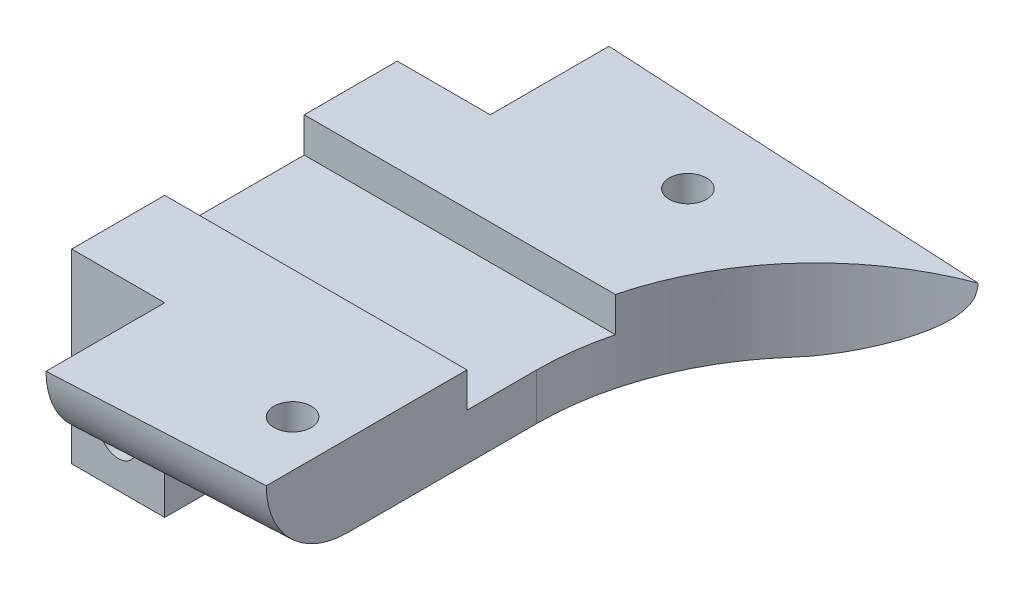
ISO-10303-21;
HEADER;
FILE_DESCRIPTION(('STEP AP214'),'2;1');
FILE_NAME('part.step','',(''),(''),'','','');
FILE_SCHEMA(('AUTOMOTIVE_DESIGN { 1 0 10303 214 1 1 1 1 }'));
ENDSEC;
DATA;
#1=APPLICATION_CONTEXT('core data for automotive mechanical design processes');
#2=APPLICATION_PROTOCOL_DEFINITION('international standard','automotive_design',2000,#1);
#3=PRODUCT_CONTEXT('',#1,'mechanical');
#4=PRODUCT('Part','Part','',(#3));
#5=PRODUCT_RELATED_PRODUCT_CATEGORY('part','',(#4));
#6=PRODUCT_DEFINITION_FORMATION('','',#4);
#7=PRODUCT_DEFINITION_CONTEXT('part definition',#1,'design');
#8=PRODUCT_DEFINITION('design','',#6,#7);
#9=PRODUCT_DEFINITION_SHAPE('','',#8);
#10=(LENGTH_UNIT() NAMED_UNIT(*) SI_UNIT(.MILLI.,.METRE.));
#11=(NAMED_UNIT(*) PLANE_ANGLE_UNIT() SI_UNIT($,.RADIAN.));
#12=(NAMED_UNIT(*) SI_UNIT($,.STERADIAN.) SOLID_ANGLE_UNIT());
#13=UNCERTAINTY_MEASURE_WITH_UNIT(LENGTH_MEASURE(1.E-05),#10,'distance_accuracy_value','');
#14=(GEOMETRIC_REPRESENTATION_CONTEXT(3) GLOBAL_UNCERTAINTY_ASSIGNED_CONTEXT((#13)) GLOBAL_UNIT_ASSIGNED_CONTEXT((#10,
#11,#12)) REPRESENTATION_CONTEXT('',''));
#15=CARTESIAN_POINT('',(0.,0.,0.));
#16=DIRECTION('',(0.,0.,1.));
#17=DIRECTION('',(1.,0.,0.));
#18=AXIS2_PLACEMENT_3D('',#15,#16,#17);
#19=CARTESIAN_POINT('',(0.,0.,0.));
#20=DIRECTION('',(0.,1.,0.));
#21=DIRECTION('',(0.,0.,1.));
#22=AXIS2_PLACEMENT_3D('',#19,#20,#21);
#23=PLANE('',#22);
#24=DIRECTION('',(-1.,0.,0.));
#25=VECTOR('',#24,1.);
#26=CARTESIAN_POINT('',(26.3810499613777,0.,-3.));
#27=LINE('',#26,#25);
#28=CARTESIAN_POINT('',(26.3810499613777,0.,-3.));
#29=VERTEX_POINT('',#28);
#30=CARTESIAN_POINT('',(13.,0.,-3.));
#31=VERTEX_POINT('',#30);
#32=EDGE_CURVE('E167',#29,#31,#27,.T.);
#33=ORIENTED_EDGE('',*,*,#32,.F.);
#34=CARTESIAN_POINT('',(38.,0.,0.));
#35=DIRECTION('',(0.,1.,0.));
#36=DIRECTION('',(0.,0.,1.));
#37=AXIS2_PLACEMENT_3D('',#34,#35,#36);
#38=CIRCLE('',#37,12.);
#39=CARTESIAN_POINT('',(33.7534704892804,0.,-11.2235015531958));
#40=VERTEX_POINT('',#39);
#41=EDGE_CURVE('E213',#40,#29,#38,.T.);
#42=ORIENTED_EDGE('',*,*,#41,.F.);
#43=DIRECTION('',(0.99861782933251,0.,0.0525588331227638));
#44=VECTOR('',#43,1.);
#45=CARTESIAN_POINT('',(0.682320441988952,0.,-12.9640883977901));
#46=LINE('',#45,#44);
#47=CARTESIAN_POINT('',(17.,0.,-12.1052631578947));
#48=VERTEX_POINT('',#47);
#49=EDGE_CURVE('E230',#48,#40,#46,.T.);
#50=ORIENTED_EDGE('',*,*,#49,.F.);
#51=DIRECTION('',(0.,0.,-1.));
#52=VECTOR('',#51,1.);
#53=CARTESIAN_POINT('',(17.,0.,0.));
#54=LINE('',#53,#52);
#55=CARTESIAN_POINT('',(17.,0.,-7.));
#56=VERTEX_POINT('',#55);
#57=EDGE_CURVE('E233',#56,#48,#54,.T.);
#58=ORIENTED_EDGE('',*,*,#57,.F.);
#59=DIRECTION('',(1.,0.,0.));
#60=VECTOR('',#59,1.);
#61=CARTESIAN_POINT('',(0.,0.,-7.));
#62=LINE('',#61,#60);
#63=CARTESIAN_POINT('',(13.,0.,-7.));
#64=VERTEX_POINT('',#63);
#65=EDGE_CURVE('E235',#64,#56,#62,.T.);
#66=ORIENTED_EDGE('',*,*,#65,.F.);
#67=DIRECTION('',(0.,0.,-1.));
#68=VECTOR('',#67,1.);
#69=CARTESIAN_POINT('',(13.,0.,0.));
#70=LINE('',#69,#68);
#71=EDGE_CURVE('E237',#31,#64,#70,.T.);
#72=ORIENTED_EDGE('',*,*,#71,.F.);
#73=EDGE_LOOP('',(#33,#42,#50,#58,#66,#72));
#74=FACE_BOUND('',#73,.T.);
#75=CARTESIAN_POINT('',(24.,0.,-8.5));
#76=DIRECTION('',(0.,1.,0.));
#77=DIRECTION('',(0.,0.,1.));
#78=AXIS2_PLACEMENT_3D('',#75,#76,#77);
#79=CIRCLE('',#78,0.799999999999999);
#80=CARTESIAN_POINT('',(24.,0.,-7.7));
#81=VERTEX_POINT('',#80);
#82=EDGE_CURVE('E208',#81,#81,#79,.T.);
#83=ORIENTED_EDGE('',*,*,#82,.F.);
#84=EDGE_LOOP('',(#83));
#85=FACE_BOUND('',#84,.T.);
#86=ADVANCED_FACE('F35',(#74,#85),#23,.T.);
#87=CARTESIAN_POINT('',(38.,-3.5,0.));
#88=DIRECTION('',(0.,1.,0.));
#89=DIRECTION('',(0.,0.,1.));
#90=AXIS2_PLACEMENT_3D('',#87,#88,#89);
#91=CYLINDRICAL_SURFACE('',#90,12.);
#92=CARTESIAN_POINT('',(38.,-3.5,0.));
#93=DIRECTION('',(0.,1.,0.));
#94=DIRECTION('',(0.,0.,1.));
#95=AXIS2_PLACEMENT_3D('',#92,#93,#94);
#96=CIRCLE('',#95,12.);
#97=CARTESIAN_POINT('',(29.0267068065038,-3.5,-7.96743429615551));
#98=VERTEX_POINT('',#97);
#99=CARTESIAN_POINT('',(26.,-3.5,0.));
#100=VERTEX_POINT('',#99);
#101=EDGE_CURVE('E216',#98,#100,#96,.T.);
#102=ORIENTED_EDGE('',*,*,#101,.F.);
#103=CARTESIAN_POINT('',(29.0267068065038,-3.5,-7.96743429615551));
#104=CARTESIAN_POINT('',(29.1252732668303,-3.49998592915876,-8.07847169006467));
#105=CARTESIAN_POINT('',(29.225875938758,-3.49422882603431,-8.18759867405111));
#106=CARTESIAN_POINT('',(29.4303821231229,-3.47218402390358,-8.40139212943517));
#107=CARTESIAN_POINT('',(29.5342817796478,-3.4559082243591,-8.50606349888512));
#108=CARTESIAN_POINT('',(29.7446788142223,-3.41380863622455,-8.71040655502651));
#109=CARTESIAN_POINT('',(29.8511720838343,-3.3879991339197,-8.81008547041522));
#110=CARTESIAN_POINT('',(30.0663558073956,-3.3276241290332,-9.00434943148595));
#111=CARTESIAN_POINT('',(30.1750471396214,-3.29305506015193,-9.09893238337351));
#112=CARTESIAN_POINT('',(30.4347936586531,-3.20148907211888,-9.3169796654036));
#113=CARTESIAN_POINT('',(30.5865702428945,-3.14093252659812,-9.43810253303063));
#114=CARTESIAN_POINT('',(30.8918335211635,-3.00597614305765,-9.67009578023478));
#115=CARTESIAN_POINT('',(31.0453208314689,-2.93157115403207,-9.78096232186822));
#116=CARTESIAN_POINT('',(31.3527130174929,-2.76963805891316,-9.99241667165639));
#117=CARTESIAN_POINT('',(31.5066181530424,-2.68209737842673,-10.092994473862));
#118=CARTESIAN_POINT('',(31.8129262540412,-2.49414470486446,-10.2836108850329));
#119=CARTESIAN_POINT('',(31.9653300027481,-2.39373985272426,-10.3736552884626));
#120=CARTESIAN_POINT('',(32.2728180980057,-2.17483217526493,-10.5466430611719));
#121=CARTESIAN_POINT('',(32.4277508224497,-2.05575082512826,-10.6291360892182));
#122=CARTESIAN_POINT('',(32.6539234009692,-1.86444098220462,-10.7436791773343));
#123=CARTESIAN_POINT('',(32.7282557430953,-1.79857744925735,-10.7803181208805));
#124=CARTESIAN_POINT('',(32.8740040079156,-1.66209687642385,-10.8503776082367));
#125=CARTESIAN_POINT('',(32.9454206641233,-1.59148104408478,-10.8837989644205));
#126=CARTESIAN_POINT('',(33.111819513482,-1.41570564880075,-10.9597910059007));
#127=CARTESIAN_POINT('',(33.2048822661748,-1.30797429777425,-11.0007164742283));
#128=CARTESIAN_POINT('',(33.3779073851249,-1.07975965164115,-11.0745219043443));
#129=CARTESIAN_POINT('',(33.4578926016463,-0.959299217824681,-11.1074159500909));
#130=CARTESIAN_POINT('',(33.5704765803645,-0.750407074012492,-11.1526495742201));
#131=CARTESIAN_POINT('',(33.609723805641,-0.666290177134787,-11.1681118713258));
#132=CARTESIAN_POINT('',(33.6756638478441,-0.492669699659191,-11.1938095934416));
#133=CARTESIAN_POINT('',(33.7024057320665,-0.403188753250098,-11.204065460758));
#134=CARTESIAN_POINT('',(33.731780145762,-0.260807190804394,-11.2152766574278));
#135=CARTESIAN_POINT('',(33.7398439949983,-0.20916760788626,-11.2183388956699));
#136=CARTESIAN_POINT('',(33.7507202468781,-0.105037502362144,-11.2224610650852));
#137=CARTESIAN_POINT('',(33.7535097116196,-0.052544259738826,-11.2235122505735));
#138=CARTESIAN_POINT('',(33.7534704892804,0.,-11.2235015531958));
#139=B_SPLINE_CURVE_WITH_KNOTS('',3,(#103,#104,#105,#106,#107,#108,#109,#110,#111,#112,#113,
#114,#115,#116,#117,#118,#119,#120,#121,#122,#123,#124,#125,#126,#127,#128,#129,#130,#131,#132,
#133,#134,#135,#136,#137,#138),.UNSPECIFIED.,.F.,.F.,(4,2,2,2,2,2,2,2,2,2,2,2,2,2,2,2,2,4),(0.,
0.44517512828659,0.889847523774546,1.33385626163774,1.7780460609189,2.38743771444605,
2.99705648923118,3.60726260081857,4.21713144116072,4.85233365635855,5.16974972326408,
5.48708543788266,5.9305856332474,6.3733024259465,6.65476901126952,6.93512174069319,
7.09190108610007,7.24936069879027),.UNSPECIFIED.);
#140=EDGE_CURVE('E44',#98,#40,#139,.T.);
#141=ORIENTED_EDGE('',*,*,#140,.T.);
#142=ORIENTED_EDGE('',*,*,#41,.T.);
#143=DIRECTION('',(0.,1.,0.));
#144=VECTOR('',#143,1.);
#145=CARTESIAN_POINT('',(26.3810499613777,-1.5,-3.));
#146=LINE('',#145,#144);
#147=CARTESIAN_POINT('',(26.3810499613777,-1.5,-3.));
#148=VERTEX_POINT('',#147);
#149=EDGE_CURVE('E173',#148,#29,#146,.T.);
#150=ORIENTED_EDGE('',*,*,#149,.F.);
#151=CARTESIAN_POINT('',(38.,-1.5,0.));
#152=DIRECTION('',(0.,1.,0.));
#153=DIRECTION('',(0.,0.,1.));
#154=AXIS2_PLACEMENT_3D('',#151,#152,#153);
#155=CIRCLE('',#154,12.);
#156=CARTESIAN_POINT('',(26.,-1.5,0.));
#157=VERTEX_POINT('',#156);
#158=EDGE_CURVE('E183',#157,#148,#155,.F.);
#159=ORIENTED_EDGE('',*,*,#158,.F.);
#160=DIRECTION('',(0.,1.,0.));
#161=VECTOR('',#160,1.);
#162=CARTESIAN_POINT('',(26.,-3.5,0.));
#163=LINE('',#162,#161);
#164=EDGE_CURVE('E250',#100,#157,#163,.T.);
#165=ORIENTED_EDGE('',*,*,#164,.F.);
#166=EDGE_LOOP('',(#102,#141,#142,#150,#159,#165));
#167=FACE_BOUND('',#166,.T.);
#168=ADVANCED_FACE('F310',(#167),#91,.F.);
#169=CARTESIAN_POINT('',(26.,-3.5,0.));
#170=DIRECTION('',(-1.,0.,0.));
#171=DIRECTION('',(0.,0.,1.));
#172=AXIS2_PLACEMENT_3D('',#169,#170,#171);
#173=PLANE('',#172);
#174=DIRECTION('',(0.,0.,1.));
#175=VECTOR('',#174,1.);
#176=CARTESIAN_POINT('',(26.,0.,0.));
#177=LINE('',#176,#175);
#178=CARTESIAN_POINT('',(26.,0.,3.));
#179=VERTEX_POINT('',#178);
#180=CARTESIAN_POINT('',(26.,0.,11.6315789473684));
#181=VERTEX_POINT('',#180);
#182=EDGE_CURVE('E219',#179,#181,#177,.T.);
#183=ORIENTED_EDGE('',*,*,#182,.T.);
#184=CARTESIAN_POINT('',(26.,0.,8.12673465439255));
#185=DIRECTION('',(-1.,0.,0.));
#186=DIRECTION('',(0.,0.,1.));
#187=AXIS2_PLACEMENT_3D('',#184,#185,#186);
#188=ELLIPSE('',#187,3.50484429297587,3.5);
#189=CARTESIAN_POINT('',(26.,-3.5,8.12673465439255));
#190=VERTEX_POINT('',#189);
#191=EDGE_CURVE('E253',#181,#190,#188,.F.);
#192=ORIENTED_EDGE('',*,*,#191,.T.);
#193=DIRECTION('',(0.,0.,1.));
#194=VECTOR('',#193,1.);
#195=CARTESIAN_POINT('',(26.,-3.5,0.));
#196=LINE('',#195,#194);
#197=EDGE_CURVE('E224',#100,#190,#196,.T.);
#198=ORIENTED_EDGE('',*,*,#197,.F.);
#199=ORIENTED_EDGE('',*,*,#164,.T.);
#200=DIRECTION('',(0.,0.,-1.));
#201=VECTOR('',#200,1.);
#202=CARTESIAN_POINT('',(26.,-1.5,0.));
#203=LINE('',#202,#201);
#204=CARTESIAN_POINT('',(26.,-1.5,3.));
#205=VERTEX_POINT('',#204);
#206=EDGE_CURVE('E181',#205,#157,#203,.T.);
#207=ORIENTED_EDGE('',*,*,#206,.F.);
#208=DIRECTION('',(0.,1.,0.));
#209=VECTOR('',#208,1.);
#210=CARTESIAN_POINT('',(26.,-3.5,3.));
#211=LINE('',#210,#209);
#212=EDGE_CURVE('E155',#205,#179,#211,.T.);
#213=ORIENTED_EDGE('',*,*,#212,.T.);
#214=EDGE_LOOP('',(#183,#192,#198,#199,#207,#213));
#215=FACE_BOUND('',#214,.T.);
#216=ADVANCED_FACE('F314',(#215),#173,.F.);
#217=CARTESIAN_POINT('',(17.,-3.5,0.));
#218=DIRECTION('',(-1.,0.,0.));
#219=DIRECTION('',(0.,0.,1.));
#220=AXIS2_PLACEMENT_3D('',#217,#218,#219);
#221=PLANE('',#220);
#222=DIRECTION('',(0.,0.,1.));
#223=VECTOR('',#222,1.);
#224=CARTESIAN_POINT('',(17.,-3.5,0.));
#225=LINE('',#224,#223);
#226=CARTESIAN_POINT('',(17.,-3.5,7.));
#227=VERTEX_POINT('',#226);
#228=CARTESIAN_POINT('',(17.,-3.5,8.60041886491887));
#229=VERTEX_POINT('',#228);
#230=EDGE_CURVE('E221',#227,#229,#225,.T.);
#231=ORIENTED_EDGE('',*,*,#230,.T.);
#232=CARTESIAN_POINT('',(17.,0.,8.60041886491887));
#233=DIRECTION('',(-1.,0.,0.));
#234=DIRECTION('',(0.,0.,1.));
#235=AXIS2_PLACEMENT_3D('',#232,#233,#234);
#236=ELLIPSE('',#235,3.50484429297587,3.5);
#237=CARTESIAN_POINT('',(17.,0.,12.1052631578947));
#238=VERTEX_POINT('',#237);
#239=EDGE_CURVE('E282',#229,#238,#236,.T.);
#240=ORIENTED_EDGE('',*,*,#239,.T.);
#241=DIRECTION('',(0.,0.,1.));
#242=VECTOR('',#241,1.);
#243=CARTESIAN_POINT('',(17.,0.,0.));
#244=LINE('',#243,#242);
#245=CARTESIAN_POINT('',(17.,0.,7.));
#246=VERTEX_POINT('',#245);
#247=EDGE_CURVE('E242',#246,#238,#244,.T.);
#248=ORIENTED_EDGE('',*,*,#247,.F.);
#249=DIRECTION('',(0.,1.,0.));
#250=VECTOR('',#249,1.);
#251=CARTESIAN_POINT('',(17.,-3.5,7.));
#252=LINE('',#251,#250);
#253=EDGE_CURVE('E254',#227,#246,#252,.T.);
#254=ORIENTED_EDGE('',*,*,#253,.F.);
#255=EDGE_LOOP('',(#231,#240,#248,#254));
#256=FACE_BOUND('',#255,.T.);
#257=ADVANCED_FACE('F328',(#256),#221,.T.);
#258=CARTESIAN_POINT('',(0.,-3.5,7.));
#259=DIRECTION('',(0.,0.,1.));
#260=DIRECTION('',(1.,0.,0.));
#261=AXIS2_PLACEMENT_3D('',#258,#259,#260);
#262=PLANE('',#261);
#263=CARTESIAN_POINT('',(15.,-6.,7.));
#264=DIRECTION('',(0.,0.,1.));
#265=DIRECTION('',(1.,0.,0.));
#266=AXIS2_PLACEMENT_3D('',#263,#264,#265);
#267=CIRCLE('',#266,0.800000000000001);
#268=CARTESIAN_POINT('',(15.8,-6.,7.));
#269=VERTEX_POINT('',#268);
#270=EDGE_CURVE('E266',#269,#269,#267,.T.);
#271=ORIENTED_EDGE('',*,*,#270,.F.);
#272=EDGE_LOOP('',(#271));
#273=FACE_BOUND('',#272,.T.);
#274=DIRECTION('',(1.,0.,0.));
#275=VECTOR('',#274,1.);
#276=CARTESIAN_POINT('',(0.,0.,7.));
#277=LINE('',#276,#275);
#278=CARTESIAN_POINT('',(13.,0.,7.));
#279=VERTEX_POINT('',#278);
#280=EDGE_CURVE('E239',#279,#246,#277,.T.);
#281=ORIENTED_EDGE('',*,*,#280,.F.);
#282=DIRECTION('',(0.,1.,0.));
#283=VECTOR('',#282,1.);
#284=CARTESIAN_POINT('',(13.,-3.5,7.));
#285=LINE('',#284,#283);
#286=CARTESIAN_POINT('',(13.,-8.,7.));
#287=VERTEX_POINT('',#286);
#288=EDGE_CURVE('E256',#287,#279,#285,.T.);
#289=ORIENTED_EDGE('',*,*,#288,.F.);
#290=DIRECTION('',(1.,0.,0.));
#291=VECTOR('',#290,1.);
#292=CARTESIAN_POINT('',(13.,-8.,7.));
#293=LINE('',#292,#291);
#294=CARTESIAN_POINT('',(17.,-8.,7.));
#295=VERTEX_POINT('',#294);
#296=EDGE_CURVE('E188',#287,#295,#293,.T.);
#297=ORIENTED_EDGE('',*,*,#296,.T.);
#298=DIRECTION('',(0.,1.,0.));
#299=VECTOR('',#298,1.);
#300=CARTESIAN_POINT('',(17.,-8.,7.));
#301=LINE('',#300,#299);
#302=EDGE_CURVE('E197',#295,#227,#301,.T.);
#303=ORIENTED_EDGE('',*,*,#302,.T.);
#304=ORIENTED_EDGE('',*,*,#253,.T.);
#305=EDGE_LOOP('',(#281,#289,#297,#303,#304));
#306=FACE_BOUND('',#305,.T.);
#307=ADVANCED_FACE('F325',(#273,#306),#262,.T.);
#308=CARTESIAN_POINT('',(13.,-3.5,0.));
#309=DIRECTION('',(1.,0.,0.));
#310=DIRECTION('',(0.,0.,-1.));
#311=AXIS2_PLACEMENT_3D('',#308,#309,#310);
#312=PLANE('',#311);
#313=DIRECTION('',(0.,0.,1.));
#314=VECTOR('',#313,1.);
#315=CARTESIAN_POINT('',(13.,-1.5,0.));
#316=LINE('',#315,#314);
#317=CARTESIAN_POINT('',(13.,-1.5,-3.));
#318=VERTEX_POINT('',#317);
#319=CARTESIAN_POINT('',(13.,-1.5,3.));
#320=VERTEX_POINT('',#319);
#321=EDGE_CURVE('E159',#318,#320,#316,.T.);
#322=ORIENTED_EDGE('',*,*,#321,.F.);
#323=DIRECTION('',(0.,1.,0.));
#324=VECTOR('',#323,1.);
#325=CARTESIAN_POINT('',(13.,-1.5,-3.));
#326=LINE('',#325,#324);
#327=EDGE_CURVE('E175',#318,#31,#326,.T.);
#328=ORIENTED_EDGE('',*,*,#327,.T.);
#329=ORIENTED_EDGE('',*,*,#71,.T.);
#330=DIRECTION('',(0.,1.,0.));
#331=VECTOR('',#330,1.);
#332=CARTESIAN_POINT('',(13.,-3.5,-7.));
#333=LINE('',#332,#331);
#334=CARTESIAN_POINT('',(13.,-8.,-7.));
#335=VERTEX_POINT('',#334);
#336=EDGE_CURVE('E258',#335,#64,#333,.T.);
#337=ORIENTED_EDGE('',*,*,#336,.F.);
#338=DIRECTION('',(0.,0.,1.));
#339=VECTOR('',#338,1.);
#340=CARTESIAN_POINT('',(13.,-8.,-7.));
#341=LINE('',#340,#339);
#342=EDGE_CURVE('E185',#335,#287,#341,.T.);
#343=ORIENTED_EDGE('',*,*,#342,.T.);
#344=ORIENTED_EDGE('',*,*,#288,.T.);
#345=CARTESIAN_POINT('',(13.,0.,3.));
#346=VERTEX_POINT('',#345);
#347=EDGE_CURVE('E172',#279,#346,#70,.T.);
#348=ORIENTED_EDGE('',*,*,#347,.T.);
#349=DIRECTION('',(0.,1.,0.));
#350=VECTOR('',#349,1.);
#351=CARTESIAN_POINT('',(13.,-1.5,3.));
#352=LINE('',#351,#350);
#353=EDGE_CURVE('E152',#320,#346,#352,.T.);
#354=ORIENTED_EDGE('',*,*,#353,.F.);
#355=EDGE_LOOP('',(#322,#328,#329,#337,#343,#344,#348,#354));
#356=FACE_BOUND('',#355,.T.);
#357=ADVANCED_FACE('F170',(#356),#312,.F.);
#358=CARTESIAN_POINT('',(0.,-3.5,-7.));
#359=DIRECTION('',(0.,0.,1.));
#360=DIRECTION('',(1.,0.,0.));
#361=AXIS2_PLACEMENT_3D('',#358,#359,#360);
#362=PLANE('',#361);
#363=CARTESIAN_POINT('',(15.,-6.,-7.));
#364=DIRECTION('',(0.,0.,1.));
#365=DIRECTION('',(1.,0.,0.));
#366=AXIS2_PLACEMENT_3D('',#363,#364,#365);
#367=CIRCLE('',#366,0.800000000000001);
#368=CARTESIAN_POINT('',(15.8,-6.,-7.));
#369=VERTEX_POINT('',#368);
#370=EDGE_CURVE('E263',#369,#369,#367,.T.);
#371=ORIENTED_EDGE('',*,*,#370,.T.);
#372=EDGE_LOOP('',(#371));
#373=FACE_BOUND('',#372,.T.);
#374=ORIENTED_EDGE('',*,*,#65,.T.);
#375=DIRECTION('',(0.,1.,0.));
#376=VECTOR('',#375,1.);
#377=CARTESIAN_POINT('',(17.,-3.5,-7.));
#378=LINE('',#377,#376);
#379=CARTESIAN_POINT('',(17.,-3.5,-7.));
#380=VERTEX_POINT('',#379);
#381=EDGE_CURVE('E227',#380,#56,#378,.T.);
#382=ORIENTED_EDGE('',*,*,#381,.F.);
#383=DIRECTION('',(0.,1.,0.));
#384=VECTOR('',#383,1.);
#385=CARTESIAN_POINT('',(17.,-8.,-7.));
#386=LINE('',#385,#384);
#387=CARTESIAN_POINT('',(17.,-8.,-7.));
#388=VERTEX_POINT('',#387);
#389=EDGE_CURVE('E198',#388,#380,#386,.T.);
#390=ORIENTED_EDGE('',*,*,#389,.F.);
#391=DIRECTION('',(-1.,0.,0.));
#392=VECTOR('',#391,1.);
#393=CARTESIAN_POINT('',(13.,-8.,-7.));
#394=LINE('',#393,#392);
#395=EDGE_CURVE('E194',#388,#335,#394,.T.);
#396=ORIENTED_EDGE('',*,*,#395,.T.);
#397=ORIENTED_EDGE('',*,*,#336,.T.);
#398=EDGE_LOOP('',(#374,#382,#390,#396,#397));
#399=FACE_BOUND('',#398,.T.);
#400=ADVANCED_FACE('F319',(#373,#399),#362,.F.);
#401=CARTESIAN_POINT('',(17.,-3.5,0.));
#402=DIRECTION('',(1.,0.,0.));
#403=DIRECTION('',(0.,0.,-1.));
#404=AXIS2_PLACEMENT_3D('',#401,#402,#403);
#405=PLANE('',#404);
#406=ORIENTED_EDGE('',*,*,#57,.T.);
#407=CARTESIAN_POINT('',(17.,0.,-8.60041886491887));
#408=DIRECTION('',(1.,0.,0.));
#409=DIRECTION('',(0.,0.,1.));
#410=AXIS2_PLACEMENT_3D('',#407,#408,#409);
#411=ELLIPSE('',#410,3.50484429297587,3.5);
#412=CARTESIAN_POINT('',(17.,-3.5,-8.60041886491887));
#413=VERTEX_POINT('',#412);
#414=EDGE_CURVE('E11',#48,#413,#411,.F.);
#415=ORIENTED_EDGE('',*,*,#414,.T.);
#416=DIRECTION('',(0.,0.,-1.));
#417=VECTOR('',#416,1.);
#418=CARTESIAN_POINT('',(17.,-3.5,0.));
#419=LINE('',#418,#417);
#420=EDGE_CURVE('E218',#380,#413,#419,.T.);
#421=ORIENTED_EDGE('',*,*,#420,.F.);
#422=ORIENTED_EDGE('',*,*,#381,.T.);
#423=EDGE_LOOP('',(#406,#415,#421,#422));
#424=FACE_BOUND('',#423,.T.);
#425=ADVANCED_FACE('F316',(#424),#405,.F.);
#426=CARTESIAN_POINT('',(0.,-3.5,0.));
#427=DIRECTION('',(0.,1.,0.));
#428=DIRECTION('',(0.,0.,1.));
#429=AXIS2_PLACEMENT_3D('',#426,#427,#428);
#430=PLANE('',#429);
#431=ORIENTED_EDGE('',*,*,#197,.T.);
#432=DIRECTION('',(0.99861782933251,0.,-0.0525588331227637));
#433=VECTOR('',#432,1.);
#434=CARTESIAN_POINT('',(16.8160440840703,-3.5,8.61010075523095));
#435=LINE('',#434,#433);
#436=CARTESIAN_POINT('',(24.7387968862693,-3.5,8.19311376564153));
#437=VERTEX_POINT('',#436);
#438=EDGE_CURVE('E274',#190,#437,#435,.F.);
#439=ORIENTED_EDGE('',*,*,#438,.T.);
#440=CARTESIAN_POINT('',(24.,-3.5,8.5));
#441=DIRECTION('',(0.,1.,0.));
#442=DIRECTION('',(0.,0.,1.));
#443=AXIS2_PLACEMENT_3D('',#440,#441,#442);
#444=CIRCLE('',#443,0.800000000000002);
#445=CARTESIAN_POINT('',(23.2330702873962,-3.5,8.27236253400328));
#446=VERTEX_POINT('',#445);
#447=EDGE_CURVE('E205',#437,#446,#444,.T.);
#448=ORIENTED_EDGE('',*,*,#447,.T.);
#449=DIRECTION('',(0.99861782933251,0.,-0.0525588331227637));
#450=VECTOR('',#449,1.);
#451=CARTESIAN_POINT('',(16.8160440840703,-3.5,8.61010075523095));
#452=LINE('',#451,#450);
#453=EDGE_CURVE('E272',#446,#229,#452,.F.);
#454=ORIENTED_EDGE('',*,*,#453,.T.);
#455=ORIENTED_EDGE('',*,*,#230,.F.);
#456=DIRECTION('',(0.,0.,-1.));
#457=VECTOR('',#456,1.);
#458=CARTESIAN_POINT('',(17.,-3.5,0.));
#459=LINE('',#458,#457);
#460=EDGE_CURVE('E200',#227,#380,#459,.T.);
#461=ORIENTED_EDGE('',*,*,#460,.T.);
#462=ORIENTED_EDGE('',*,*,#420,.T.);
#463=DIRECTION('',(0.99861782933251,0.,0.0525588331227638));
#464=VECTOR('',#463,1.);
#465=CARTESIAN_POINT('',(0.498364526059279,-3.5,-9.46892599512628));
#466=LINE('',#465,#464);
#467=CARTESIAN_POINT('',(23.2330702873962,-3.5,-8.27236253400328));
#468=VERTEX_POINT('',#467);
#469=EDGE_CURVE('E269',#413,#468,#466,.T.);
#470=ORIENTED_EDGE('',*,*,#469,.T.);
#471=CARTESIAN_POINT('',(24.,-3.5,-8.5));
#472=DIRECTION('',(0.,1.,0.));
#473=DIRECTION('',(0.,0.,1.));
#474=AXIS2_PLACEMENT_3D('',#471,#472,#473);
#475=CIRCLE('',#474,0.799999999999999);
#476=CARTESIAN_POINT('',(24.7387968862693,-3.5,-8.19311376564153));
#477=VERTEX_POINT('',#476);
#478=EDGE_CURVE('E211',#468,#477,#475,.T.);
#479=ORIENTED_EDGE('',*,*,#478,.T.);
#480=DIRECTION('',(0.99861782933251,0.,0.0525588331227638));
#481=VECTOR('',#480,1.);
#482=CARTESIAN_POINT('',(0.498364526059279,-3.5,-9.46892599512628));
#483=LINE('',#482,#481);
#484=EDGE_CURVE('E51',#477,#98,#483,.T.);
#485=ORIENTED_EDGE('',*,*,#484,.T.);
#486=ORIENTED_EDGE('',*,*,#101,.T.);
#487=EDGE_LOOP('',(#431,#439,#448,#454,#455,#461,#462,#470,#479,#485,#486));
#488=FACE_BOUND('',#487,.T.);
#489=ADVANCED_FACE('F301',(#488),#430,.F.);
#490=DIRECTION('',(1.,0.,0.));
#491=VECTOR('',#490,1.);
#492=CARTESIAN_POINT('',(13.,0.,3.));
#493=LINE('',#492,#491);
#494=EDGE_CURVE('E354',#346,#179,#493,.T.);
#495=ORIENTED_EDGE('',*,*,#494,.F.);
#496=ORIENTED_EDGE('',*,*,#347,.F.);
#497=ORIENTED_EDGE('',*,*,#280,.T.);
#498=ORIENTED_EDGE('',*,*,#247,.T.);
#499=DIRECTION('',(0.99861782933251,0.,-0.0525588331227637));
#500=VECTOR('',#499,1.);
#501=CARTESIAN_POINT('',(0.682320441988951,0.,12.9640883977901));
#502=LINE('',#501,#500);
#503=EDGE_CURVE('E245',#238,#181,#502,.T.);
#504=ORIENTED_EDGE('',*,*,#503,.T.);
#505=ORIENTED_EDGE('',*,*,#182,.F.);
#506=EDGE_LOOP('',(#495,#496,#497,#498,#504,#505));
#507=FACE_BOUND('',#506,.T.);
#508=CARTESIAN_POINT('',(24.,0.,8.5));
#509=DIRECTION('',(0.,1.,0.));
#510=DIRECTION('',(0.,0.,1.));
#511=AXIS2_PLACEMENT_3D('',#508,#509,#510);
#512=CIRCLE('',#511,0.800000000000002);
#513=CARTESIAN_POINT('',(24.,0.,9.3));
#514=VERTEX_POINT('',#513);
#515=EDGE_CURVE('E204',#514,#514,#512,.T.);
#516=ORIENTED_EDGE('',*,*,#515,.F.);
#517=EDGE_LOOP('',(#516));
#518=FACE_BOUND('',#517,.T.);
#519=ADVANCED_FACE('F299',(#507,#518),#23,.T.);
#520=CARTESIAN_POINT('',(24.,-3.5,-8.5));
#521=DIRECTION('',(0.,1.,0.));
#522=DIRECTION('',(0.,0.,1.));
#523=AXIS2_PLACEMENT_3D('',#520,#521,#522);
#524=CYLINDRICAL_SURFACE('',#523,0.799999999999999);
#525=ORIENTED_EDGE('',*,*,#478,.F.);
#526=CARTESIAN_POINT('',(23.2330702873962,-3.5,-8.27236253400328));
#527=CARTESIAN_POINT('',(23.2204669427282,-3.50003159754214,-8.31467383003178));
#528=CARTESIAN_POINT('',(23.2114501383242,-3.49926027382538,-8.3580364198569));
#529=CARTESIAN_POINT('',(23.2006542725902,-3.4960702089167,-8.44552615346108));
#530=CARTESIAN_POINT('',(23.1988637649091,-3.49365408017397,-8.48965197683829));
#531=CARTESIAN_POINT('',(23.2025455972142,-3.4871319268166,-8.57748949187993));
#532=CARTESIAN_POINT('',(23.2080207857722,-3.48302523984121,-8.62120101434633));
#533=CARTESIAN_POINT('',(23.2259966548303,-3.47330577832524,-8.70697367089576));
#534=CARTESIAN_POINT('',(23.2384973992171,-3.46769299008921,-8.74903478996717));
#535=CARTESIAN_POINT('',(23.2702765507715,-3.45522582751165,-8.83083165129679));
#536=CARTESIAN_POINT('',(23.2896247558931,-3.44835903348009,-8.87053833458932));
#537=CARTESIAN_POINT('',(23.3345049202159,-3.43389447507147,-8.94615062238017));
#538=CARTESIAN_POINT('',(23.3600389440518,-3.4262964671493,-8.98205495200835));
#539=CARTESIAN_POINT('',(23.4174734274403,-3.41069965225589,-9.05018810209203));
#540=CARTESIAN_POINT('',(23.4495421101206,-3.40269566193568,-9.08227408919401));
#541=CARTESIAN_POINT('',(23.5187043952856,-3.38717619146531,-9.1406260401722));
#542=CARTESIAN_POINT('',(23.555798137627,-3.37966072492029,-9.16689184200822));
#543=CARTESIAN_POINT('',(23.6343120937959,-3.36575124334898,-9.21299171714887));
#544=CARTESIAN_POINT('',(23.6757580794184,-3.3593645877463,-9.23278425037183));
#545=CARTESIAN_POINT('',(23.7616367376723,-3.34840777383612,-9.26503930697199));
#546=CARTESIAN_POINT('',(23.8060686270374,-3.34383714130476,-9.27750374436647));
#547=CARTESIAN_POINT('',(23.8949785674457,-3.33712345901326,-9.29432000018431));
#548=CARTESIAN_POINT('',(23.9393989801764,-3.33489998738933,-9.29894411794851));
#549=CARTESIAN_POINT('',(24.0284404987278,-3.33283374269759,-9.30073263108349));
#550=CARTESIAN_POINT('',(24.0730615534896,-3.33299039481099,-9.29789882773811));
#551=CARTESIAN_POINT('',(24.1596036101649,-3.33561876140236,-9.28509493036395));
#552=CARTESIAN_POINT('',(24.2015645752629,-3.33800994941367,-9.2753758941051));
#553=CARTESIAN_POINT('',(24.2832440721979,-3.3447562979514,-9.24940624620749));
#554=CARTESIAN_POINT('',(24.3229624321008,-3.3491116088321,-9.23315513454648));
#555=CARTESIAN_POINT('',(24.3996111439369,-3.35944578089292,-9.19439091436543));
#556=CARTESIAN_POINT('',(24.436500493714,-3.36544423432291,-9.17180215367119));
#557=CARTESIAN_POINT('',(24.5060507055329,-3.37851080788759,-9.12110048659928));
#558=CARTESIAN_POINT('',(24.5387106448058,-3.38557916072479,-9.09298637806373));
#559=CARTESIAN_POINT('',(24.6003401829932,-3.40052174437248,-9.03065347537264));
#560=CARTESIAN_POINT('',(24.6290934102839,-3.40841747485743,-8.99622570319958));
#561=CARTESIAN_POINT('',(24.6804696146717,-3.42409719615052,-8.92303741679926));
#562=CARTESIAN_POINT('',(24.7030917339032,-3.43188117117766,-8.88427629731999));
#563=CARTESIAN_POINT('',(24.7419774910583,-3.44688821134773,-8.80258302815247));
#564=CARTESIAN_POINT('',(24.7581032027432,-3.45409673933511,-8.75958234874519));
#565=CARTESIAN_POINT('',(24.7827956608969,-3.46723463376616,-8.67126645538822));
#566=CARTESIAN_POINT('',(24.7913623349599,-3.4731639879566,-8.62595121927249));
#567=CARTESIAN_POINT('',(24.8004951432223,-3.483251843394,-8.53526471482554));
#568=CARTESIAN_POINT('',(24.8012188939985,-3.48744359665504,-8.48991294602885));
#569=CARTESIAN_POINT('',(24.7949640887805,-3.49403654820066,-8.39963391009262));
#570=CARTESIAN_POINT('',(24.7879944680704,-3.49643981825445,-8.35470621149092));
#571=CARTESIAN_POINT('',(24.7723964082063,-3.49865481313432,-8.2906371759905));
#572=CARTESIAN_POINT('',(24.7667301202459,-3.49916513126948,-8.27075676786123));
#573=CARTESIAN_POINT('',(24.7538866531283,-3.49983763099566,-8.23152380059892));
#574=CARTESIAN_POINT('',(24.7467122218279,-3.50000043981647,-8.21217035280298));
#575=CARTESIAN_POINT('',(24.7387968862694,-3.50000000000001,-8.19311376564152));
#576=B_SPLINE_CURVE_WITH_KNOTS('',3,(#526,#527,#528,#529,#530,#531,#532,#533,#534,#535,#536,
#537,#538,#539,#540,#541,#542,#543,#544,#545,#546,#547,#548,#549,#550,#551,#552,#553,#554,#555,
#556,#557,#558,#559,#560,#561,#562,#563,#564,#565,#566,#567,#568,#569,#570,#571,#572,#573,#574,
#575),.UNSPECIFIED.,.F.,.F.,(4,2,2,2,2,2,2,2,2,2,2,2,2,2,2,2,2,2,2,2,2,2,2,2,4),(0.,
0.132264349054724,0.264319110842768,0.396425661007378,0.52853341249952,0.662028512386435,
0.795568230338789,0.933119960684728,1.07067552013689,1.2090972260623,1.34748276169457,
1.48095542557509,1.61439585525994,1.74320560489138,1.87202521662733,2.00245323556397,
2.13290966339068,2.26892138187441,2.40495212132571,2.54373543576702,2.68252007955731,
2.81851031643925,2.95434277670842,3.01632365492035,3.07819256708785),.UNSPECIFIED.);
#577=EDGE_CURVE('E303',#468,#477,#576,.T.);
#578=ORIENTED_EDGE('',*,*,#577,.T.);
#579=EDGE_LOOP('',(#525,#578));
#580=FACE_BOUND('',#579,.T.);
#581=ORIENTED_EDGE('',*,*,#82,.T.);
#582=EDGE_LOOP('',(#581));
#583=FACE_BOUND('',#582,.T.);
#584=ADVANCED_FACE('F293',(#580,#583),#524,.F.);
#585=CARTESIAN_POINT('',(24.,-3.5,8.5));
#586=DIRECTION('',(0.,1.,0.));
#587=DIRECTION('',(0.,0.,1.));
#588=AXIS2_PLACEMENT_3D('',#585,#586,#587);
#589=CYLINDRICAL_SURFACE('',#588,0.800000000000002);
#590=ORIENTED_EDGE('',*,*,#447,.F.);
#591=CARTESIAN_POINT('',(24.7387968862693,-3.5,8.19311376564153));
#592=CARTESIAN_POINT('',(24.7557721164615,-3.50003159754214,8.23386829457214));
#593=CARTESIAN_POINT('',(24.7692909783366,-3.49926027382538,8.27604479669835));
#594=CARTESIAN_POINT('',(24.7892112035885,-3.4960702089167,8.36191789393485));
#595=CARTESIAN_POINT('',(24.7956238114712,-3.49365408017397,8.40561197438765));
#596=CARTESIAN_POINT('',(24.8011828334097,-3.4871319268166,8.49335068997491));
#597=CARTESIAN_POINT('',(24.8003263968706,-3.48302523984121,8.53739545586746));
#598=CARTESIAN_POINT('',(24.7914536015336,-3.47330577832524,8.62458120001664));
#599=CARTESIAN_POINT('',(24.783437177626,-3.46769299008921,8.66772217005092));
#600=CARTESIAN_POINT('',(24.7604200123523,-3.45522582751165,8.75240304805569));
#601=CARTESIAN_POINT('',(24.7453468082676,-3.44835903348009,8.79392138446435));
#602=CARTESIAN_POINT('',(24.7086518021346,-3.43389447507147,8.87382710227919));
#603=CARTESIAN_POINT('',(24.6870278130323,-3.4262964671493,8.91221343258832));
#604=CARTESIAN_POINT('',(24.6370627458591,-3.41069965225589,8.9859991905963));
#605=CARTESIAN_POINT('',(24.6085393805137,-3.40269566193568,9.02127423285753));
#606=CARTESIAN_POINT('',(24.5458845503418,-3.38717619146531,9.08656392674819));
#607=CARTESIAN_POINT('',(24.5117529294215,-3.37966072492029,9.11657843191378));
#608=CARTESIAN_POINT('',(24.4385119654286,-3.36575124334898,9.17066540811557));
#609=CARTESIAN_POINT('',(24.3993726323854,-3.3593645877463,9.19469927389988));
#610=CARTESIAN_POINT('',(24.317354331776,-3.34840777383612,9.23579101254549));
#611=CARTESIAN_POINT('',(24.2744763440676,-3.34383714130475,9.25285070662804));
#612=CARTESIAN_POINT('',(24.187822861123,-3.33712345901326,9.27890714262236));
#613=CARTESIAN_POINT('',(24.1441332696645,-3.33489998738933,9.28816862902809));
#614=CARTESIAN_POINT('',(24.0557714376773,-3.33283374269759,9.29929416061247));
#615=CARTESIAN_POINT('',(24.0110994370105,-3.33299039481099,9.30115999176333));
#616=CARTESIAN_POINT('',(23.9236914577196,-3.33561876140236,9.29751135944003));
#617=CARTESIAN_POINT('',(23.8809420908325,-3.33800994941367,9.2922507617067));
#618=CARTESIAN_POINT('',(23.7969877662006,-3.3447562979514,9.27499868336524));
#619=CARTESIAN_POINT('',(23.7557829269516,-3.3491116088321,9.26300668744907));
#620=CARTESIAN_POINT('',(23.6754885163773,-3.35944578089292,9.23250263160542));
#621=CARTESIAN_POINT('',(23.6364317792885,-3.36544423432291,9.2139110333778));
#622=CARTESIAN_POINT('',(23.5619435483396,-3.37851080788759,9.17079033697788));
#623=CARTESIAN_POINT('',(23.5265128459568,-3.38557916072478,9.14625994642421));
#624=CARTESIAN_POINT('',(23.4586805695762,-3.40052174437248,9.09074082344723));
#625=CARTESIAN_POINT('',(23.4264722348602,-3.40841747485743,9.05952155453767));
#626=CARTESIAN_POINT('',(23.3676971286093,-3.42409719615052,8.99213070553938));
#627=CARTESIAN_POINT('',(23.3411311466658,-3.43188117117766,8.95595843349038));
#628=CARTESIAN_POINT('',(23.2938846914055,-3.44688821134773,8.87879843866051));
#629=CARTESIAN_POINT('',(23.2733341885766,-3.45409673933511,8.8377280863329));
#630=CARTESIAN_POINT('',(23.2395074237068,-3.46723463376616,8.75249215208243));
#631=CARTESIAN_POINT('',(23.2262312313447,-3.4731639879566,8.70832654051539));
#632=CARTESIAN_POINT('',(23.2076293027716,-3.483251843394,8.61909975905979));
#633=CARTESIAN_POINT('',(23.2021488677062,-3.48744359665504,8.57407452636001));
#634=CARTESIAN_POINT('',(23.198892311112,-3.49403654820066,8.48363768786465));
#635=CARTESIAN_POINT('',(23.2011072583737,-3.49643981825445,8.43822659094863));
#636=CARTESIAN_POINT('',(23.2098936622468,-3.49865481313432,8.37287416261994));
#637=CARTESIAN_POINT('',(23.2134417510779,-3.49916513126948,8.35250878729112));
#638=CARTESIAN_POINT('',(23.2220958820348,-3.49983763099566,8.31214436749858));
#639=CARTESIAN_POINT('',(23.2271990982002,-3.50000043981647,8.29214472773076));
#640=CARTESIAN_POINT('',(23.2330702873961,-3.50000000000001,8.27236253400328));
#641=B_SPLINE_CURVE_WITH_KNOTS('',3,(#591,#592,#593,#594,#595,#596,#597,#598,#599,#600,#601,
#602,#603,#604,#605,#606,#607,#608,#609,#610,#611,#612,#613,#614,#615,#616,#617,#618,#619,#620,
#621,#622,#623,#624,#625,#626,#627,#628,#629,#630,#631,#632,#633,#634,#635,#636,#637,#638,#639,
#640),.UNSPECIFIED.,.F.,.F.,(4,2,2,2,2,2,2,2,2,2,2,2,2,2,2,2,2,2,2,2,2,2,2,2,4),(0.,
0.132264349054726,0.26431911084277,0.396425661007381,0.528533412499524,0.662028512386438,
0.795568230338791,0.933119960684734,1.07067552013689,1.20909722606231,1.34748276169458,
1.4809554255751,1.61439585525995,1.74320560489139,1.87202521662733,2.00245323556397,
2.13290966339069,2.26892138187443,2.40495212132572,2.54373543576703,2.68252007955732,
2.81851031643926,2.95434277670843,3.01632365492036,3.07819256708785),.UNSPECIFIED.);
#642=EDGE_CURVE('E276',#437,#446,#641,.T.);
#643=ORIENTED_EDGE('',*,*,#642,.T.);
#644=EDGE_LOOP('',(#590,#643));
#645=FACE_BOUND('',#644,.T.);
#646=ORIENTED_EDGE('',*,*,#515,.T.);
#647=EDGE_LOOP('',(#646));
#648=FACE_BOUND('',#647,.T.);
#649=ADVANCED_FACE('F287',(#645,#648),#589,.F.);
#650=CARTESIAN_POINT('',(17.,-8.,-7.));
#651=DIRECTION('',(1.,0.,0.));
#652=DIRECTION('',(0.,0.,-1.));
#653=AXIS2_PLACEMENT_3D('',#650,#651,#652);
#654=PLANE('',#653);
#655=ORIENTED_EDGE('',*,*,#460,.F.);
#656=ORIENTED_EDGE('',*,*,#302,.F.);
#657=DIRECTION('',(0.,0.,-1.));
#658=VECTOR('',#657,1.);
#659=CARTESIAN_POINT('',(17.,-8.,-7.));
#660=LINE('',#659,#658);
#661=EDGE_CURVE('E191',#295,#388,#660,.T.);
#662=ORIENTED_EDGE('',*,*,#661,.T.);
#663=ORIENTED_EDGE('',*,*,#389,.T.);
#664=EDGE_LOOP('',(#655,#656,#662,#663));
#665=FACE_BOUND('',#664,.T.);
#666=ADVANCED_FACE('F292',(#665),#654,.T.);
#667=CARTESIAN_POINT('',(0.,-8.,0.));
#668=DIRECTION('',(0.,1.,0.));
#669=DIRECTION('',(0.,0.,1.));
#670=AXIS2_PLACEMENT_3D('',#667,#668,#669);
#671=PLANE('',#670);
#672=ORIENTED_EDGE('',*,*,#342,.F.);
#673=ORIENTED_EDGE('',*,*,#395,.F.);
#674=ORIENTED_EDGE('',*,*,#661,.F.);
#675=ORIENTED_EDGE('',*,*,#296,.F.);
#676=EDGE_LOOP('',(#672,#673,#674,#675));
#677=FACE_BOUND('',#676,.T.);
#678=ADVANCED_FACE('F369',(#677),#671,.F.);
#679=CARTESIAN_POINT('',(0.,-1.5,0.));
#680=DIRECTION('',(0.,1.,0.));
#681=DIRECTION('',(0.,0.,1.));
#682=AXIS2_PLACEMENT_3D('',#679,#680,#681);
#683=PLANE('',#682);
#684=ORIENTED_EDGE('',*,*,#158,.T.);
#685=DIRECTION('',(-1.,0.,0.));
#686=VECTOR('',#685,1.);
#687=CARTESIAN_POINT('',(26.3810499613777,-1.5,-3.));
#688=LINE('',#687,#686);
#689=EDGE_CURVE('E158',#148,#318,#688,.T.);
#690=ORIENTED_EDGE('',*,*,#689,.T.);
#691=ORIENTED_EDGE('',*,*,#321,.T.);
#692=DIRECTION('',(1.,0.,0.));
#693=VECTOR('',#692,1.);
#694=CARTESIAN_POINT('',(13.,-1.5,3.));
#695=LINE('',#694,#693);
#696=EDGE_CURVE('E148',#320,#205,#695,.T.);
#697=ORIENTED_EDGE('',*,*,#696,.T.);
#698=ORIENTED_EDGE('',*,*,#206,.T.);
#699=EDGE_LOOP('',(#684,#690,#691,#697,#698));
#700=FACE_BOUND('',#699,.T.);
#701=ADVANCED_FACE('F163',(#700),#683,.T.);
#702=CARTESIAN_POINT('',(13.,-1.5,3.));
#703=DIRECTION('',(0.,0.,1.));
#704=DIRECTION('',(1.,0.,0.));
#705=AXIS2_PLACEMENT_3D('',#702,#703,#704);
#706=PLANE('',#705);
#707=ORIENTED_EDGE('',*,*,#696,.F.);
#708=ORIENTED_EDGE('',*,*,#353,.T.);
#709=ORIENTED_EDGE('',*,*,#494,.T.);
#710=ORIENTED_EDGE('',*,*,#212,.F.);
#711=EDGE_LOOP('',(#707,#708,#709,#710));
#712=FACE_BOUND('',#711,.T.);
#713=ADVANCED_FACE('F150',(#712),#706,.F.);
#714=CARTESIAN_POINT('',(26.3810499613777,-1.5,-3.));
#715=DIRECTION('',(0.,0.,-1.));
#716=DIRECTION('',(-1.,0.,0.));
#717=AXIS2_PLACEMENT_3D('',#714,#715,#716);
#718=PLANE('',#717);
#719=ORIENTED_EDGE('',*,*,#32,.T.);
#720=ORIENTED_EDGE('',*,*,#327,.F.);
#721=ORIENTED_EDGE('',*,*,#689,.F.);
#722=ORIENTED_EDGE('',*,*,#149,.T.);
#723=EDGE_LOOP('',(#719,#720,#721,#722));
#724=FACE_BOUND('',#723,.T.);
#725=ADVANCED_FACE('F378',(#724),#718,.F.);
#726=CARTESIAN_POINT('',(15.,-6.,-12.1052631578947));
#727=DIRECTION('',(0.,0.,1.));
#728=DIRECTION('',(1.,0.,0.));
#729=AXIS2_PLACEMENT_3D('',#726,#727,#728);
#730=CYLINDRICAL_SURFACE('',#729,0.800000000000001);
#731=ORIENTED_EDGE('',*,*,#270,.T.);
#732=EDGE_LOOP('',(#731));
#733=FACE_BOUND('',#732,.T.);
#734=ORIENTED_EDGE('',*,*,#370,.F.);
#735=EDGE_LOOP('',(#734));
#736=FACE_BOUND('',#735,.T.);
#737=ADVANCED_FACE('F380',(#733,#736),#730,.F.);
#738=CARTESIAN_POINT('',(0.498364526059278,0.,9.46892599512628));
#739=DIRECTION('',(-0.99861782933251,0.,0.0525588331227637));
#740=DIRECTION('',(0.0525588331227637,0.,0.99861782933251));
#741=AXIS2_PLACEMENT_3D('',#738,#739,#740);
#742=CYLINDRICAL_SURFACE('',#741,3.5);
#743=ORIENTED_EDGE('',*,*,#642,.F.);
#744=ORIENTED_EDGE('',*,*,#438,.F.);
#745=ORIENTED_EDGE('',*,*,#191,.F.);
#746=ORIENTED_EDGE('',*,*,#503,.F.);
#747=ORIENTED_EDGE('',*,*,#239,.F.);
#748=ORIENTED_EDGE('',*,*,#453,.F.);
#749=EDGE_LOOP('',(#743,#744,#745,#746,#747,#748));
#750=FACE_BOUND('',#749,.T.);
#751=ADVANCED_FACE('F284',(#750),#742,.T.);
#752=CARTESIAN_POINT('',(0.498364526059279,0.,-9.46892599512628));
#753=DIRECTION('',(0.99861782933251,0.,0.0525588331227638));
#754=DIRECTION('',(0.0525588331227638,0.,-0.99861782933251));
#755=AXIS2_PLACEMENT_3D('',#752,#753,#754);
#756=CYLINDRICAL_SURFACE('',#755,3.5);
#757=ORIENTED_EDGE('',*,*,#414,.F.);
#758=ORIENTED_EDGE('',*,*,#49,.T.);
#759=ORIENTED_EDGE('',*,*,#140,.F.);
#760=ORIENTED_EDGE('',*,*,#484,.F.);
#761=ORIENTED_EDGE('',*,*,#577,.F.);
#762=ORIENTED_EDGE('',*,*,#469,.F.);
#763=EDGE_LOOP('',(#757,#758,#759,#760,#761,#762));
#764=FACE_BOUND('',#763,.T.);
#765=ADVANCED_FACE('F37',(#764),#756,.T.);
#766=CLOSED_SHELL('',(#86,#168,#216,#257,#307,#357,#400,#425,#489,#519,#584,#649,#666,#678,#701,
#713,#725,#737,#751,#765));
#767=MANIFOLD_SOLID_BREP('B2',#766);
#768=ADVANCED_BREP_SHAPE_REPRESENTATION('',(#18,#767),#14);
#769=SHAPE_DEFINITION_REPRESENTATION(#9,#768);
ENDSEC;
END-ISO-10303-21;
